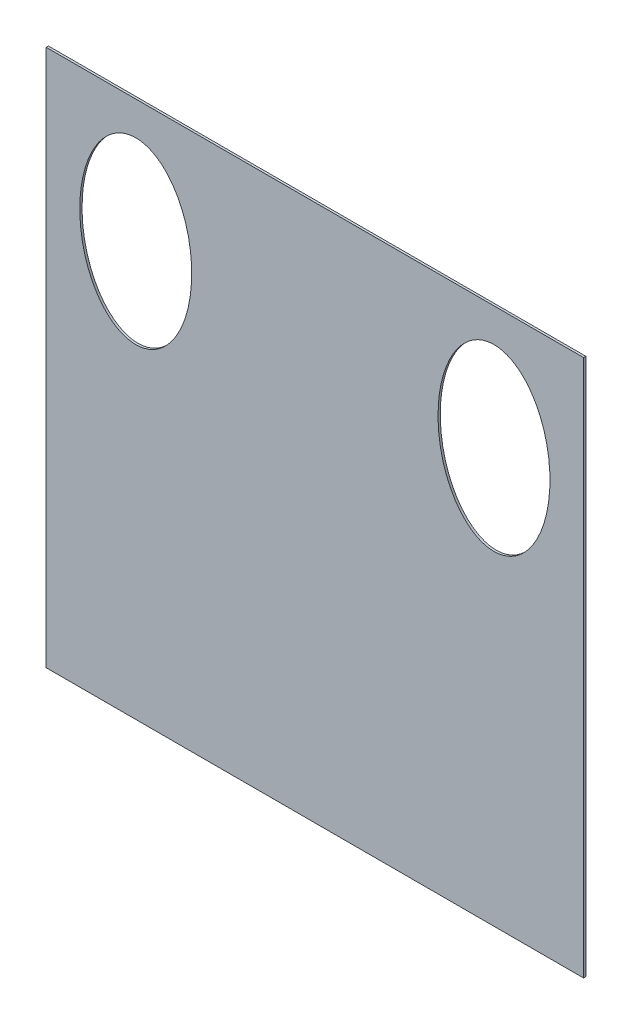
ISO-10303-21;
HEADER;
FILE_DESCRIPTION(('STEP AP214'),'2;1');
FILE_NAME('part.step','',(''),(''),'','','');
FILE_SCHEMA(('AUTOMOTIVE_DESIGN { 1 0 10303 214 1 1 1 1 }'));
ENDSEC;
DATA;
#1=APPLICATION_CONTEXT('core data for automotive mechanical design processes');
#2=APPLICATION_PROTOCOL_DEFINITION('international standard','automotive_design',2000,#1);
#3=PRODUCT_CONTEXT('',#1,'mechanical');
#4=PRODUCT('Part','Part','',(#3));
#5=PRODUCT_RELATED_PRODUCT_CATEGORY('part','',(#4));
#6=PRODUCT_DEFINITION_FORMATION('','',#4);
#7=PRODUCT_DEFINITION_CONTEXT('part definition',#1,'design');
#8=PRODUCT_DEFINITION('design','',#6,#7);
#9=PRODUCT_DEFINITION_SHAPE('','',#8);
#10=(LENGTH_UNIT() NAMED_UNIT(*) SI_UNIT(.MILLI.,.METRE.));
#11=(NAMED_UNIT(*) PLANE_ANGLE_UNIT() SI_UNIT($,.RADIAN.));
#12=(NAMED_UNIT(*) SI_UNIT($,.STERADIAN.) SOLID_ANGLE_UNIT());
#13=UNCERTAINTY_MEASURE_WITH_UNIT(LENGTH_MEASURE(1.E-05),#10,'distance_accuracy_value','');
#14=(GEOMETRIC_REPRESENTATION_CONTEXT(3) GLOBAL_UNCERTAINTY_ASSIGNED_CONTEXT((#13)) GLOBAL_UNIT_ASSIGNED_CONTEXT((#10,
#11,#12)) REPRESENTATION_CONTEXT('',''));
#15=CARTESIAN_POINT('',(0.,0.,0.));
#16=DIRECTION('',(0.,0.,1.));
#17=DIRECTION('',(1.,0.,0.));
#18=AXIS2_PLACEMENT_3D('',#15,#16,#17);
#19=CARTESIAN_POINT('',(-183.887603305785,299.132231404959,2.54));
#20=DIRECTION('',(1.,0.,0.));
#21=DIRECTION('',(0.,0.,-1.));
#22=AXIS2_PLACEMENT_3D('',#19,#20,#21);
#23=PLANE('',#22);
#24=DIRECTION('',(0.,-1.,0.));
#25=VECTOR('',#24,1.);
#26=CARTESIAN_POINT('',(-183.887603305785,299.132231404959,0.));
#27=LINE('',#26,#25);
#28=CARTESIAN_POINT('',(-183.887603305785,299.132231404959,0.));
#29=VERTEX_POINT('',#28);
#30=CARTESIAN_POINT('',(-183.887603305785,-310.467768595041,0.));
#31=VERTEX_POINT('',#30);
#32=EDGE_CURVE('E96',#29,#31,#27,.T.);
#33=ORIENTED_EDGE('',*,*,#32,.T.);
#34=DIRECTION('',(0.,0.,-1.));
#35=VECTOR('',#34,1.);
#36=CARTESIAN_POINT('',(-183.887603305785,-310.467768595041,2.54));
#37=LINE('',#36,#35);
#38=CARTESIAN_POINT('',(-183.887603305785,-310.467768595041,2.54));
#39=VERTEX_POINT('',#38);
#40=EDGE_CURVE('E11',#39,#31,#37,.T.);
#41=ORIENTED_EDGE('',*,*,#40,.F.);
#42=DIRECTION('',(0.,-1.,0.));
#43=VECTOR('',#42,1.);
#44=CARTESIAN_POINT('',(-183.887603305785,299.132231404959,2.54));
#45=LINE('',#44,#43);
#46=CARTESIAN_POINT('',(-183.887603305785,299.132231404959,2.54));
#47=VERTEX_POINT('',#46);
#48=EDGE_CURVE('E84',#47,#39,#45,.T.);
#49=ORIENTED_EDGE('',*,*,#48,.F.);
#50=DIRECTION('',(0.,0.,-1.));
#51=VECTOR('',#50,1.);
#52=CARTESIAN_POINT('',(-183.887603305785,299.132231404959,2.54));
#53=LINE('',#52,#51);
#54=EDGE_CURVE('E92',#47,#29,#53,.T.);
#55=ORIENTED_EDGE('',*,*,#54,.T.);
#56=EDGE_LOOP('',(#33,#41,#49,#55));
#57=FACE_BOUND('',#56,.T.);
#58=ADVANCED_FACE('F33',(#57),#23,.F.);
#59=CARTESIAN_POINT('',(-183.887603305785,-310.467768595041,2.54));
#60=DIRECTION('',(0.,1.,0.));
#61=DIRECTION('',(-1.,0.,0.));
#62=AXIS2_PLACEMENT_3D('',#59,#60,#61);
#63=PLANE('',#62);
#64=DIRECTION('',(1.,0.,0.));
#65=VECTOR('',#64,1.);
#66=CARTESIAN_POINT('',(-183.887603305785,-310.467768595041,0.));
#67=LINE('',#66,#65);
#68=CARTESIAN_POINT('',(425.712396694215,-310.467768595041,0.));
#69=VERTEX_POINT('',#68);
#70=EDGE_CURVE('E88',#31,#69,#67,.T.);
#71=ORIENTED_EDGE('',*,*,#70,.T.);
#72=DIRECTION('',(0.,0.,-1.));
#73=VECTOR('',#72,1.);
#74=CARTESIAN_POINT('',(425.712396694215,-310.467768595041,2.54));
#75=LINE('',#74,#73);
#76=CARTESIAN_POINT('',(425.712396694215,-310.467768595041,2.54));
#77=VERTEX_POINT('',#76);
#78=EDGE_CURVE('E41',#77,#69,#75,.T.);
#79=ORIENTED_EDGE('',*,*,#78,.F.);
#80=DIRECTION('',(1.,0.,0.));
#81=VECTOR('',#80,1.);
#82=CARTESIAN_POINT('',(-183.887603305785,-310.467768595041,2.54));
#83=LINE('',#82,#81);
#84=EDGE_CURVE('E79',#39,#77,#83,.T.);
#85=ORIENTED_EDGE('',*,*,#84,.F.);
#86=ORIENTED_EDGE('',*,*,#40,.T.);
#87=EDGE_LOOP('',(#71,#79,#85,#86));
#88=FACE_BOUND('',#87,.T.);
#89=ADVANCED_FACE('F87',(#88),#63,.F.);
#90=CARTESIAN_POINT('',(425.712396694215,299.132231404959,2.54));
#91=DIRECTION('',(-1.,0.,0.));
#92=DIRECTION('',(0.,-1.,0.));
#93=AXIS2_PLACEMENT_3D('',#90,#91,#92);
#94=PLANE('',#93);
#95=DIRECTION('',(0.,1.,0.));
#96=VECTOR('',#95,1.);
#97=CARTESIAN_POINT('',(425.712396694215,299.132231404959,0.));
#98=LINE('',#97,#96);
#99=CARTESIAN_POINT('',(425.712396694215,299.132231404959,0.));
#100=VERTEX_POINT('',#99);
#101=EDGE_CURVE('E66',#69,#100,#98,.T.);
#102=ORIENTED_EDGE('',*,*,#101,.T.);
#103=DIRECTION('',(0.,0.,-1.));
#104=VECTOR('',#103,1.);
#105=CARTESIAN_POINT('',(425.712396694215,299.132231404959,2.54));
#106=LINE('',#105,#104);
#107=CARTESIAN_POINT('',(425.712396694215,299.132231404959,2.54));
#108=VERTEX_POINT('',#107);
#109=EDGE_CURVE('E89',#108,#100,#106,.T.);
#110=ORIENTED_EDGE('',*,*,#109,.F.);
#111=DIRECTION('',(0.,1.,0.));
#112=VECTOR('',#111,1.);
#113=CARTESIAN_POINT('',(425.712396694215,299.132231404959,2.54));
#114=LINE('',#113,#112);
#115=EDGE_CURVE('E82',#77,#108,#114,.T.);
#116=ORIENTED_EDGE('',*,*,#115,.F.);
#117=ORIENTED_EDGE('',*,*,#78,.T.);
#118=EDGE_LOOP('',(#102,#110,#116,#117));
#119=FACE_BOUND('',#118,.T.);
#120=ADVANCED_FACE('F90',(#119),#94,.F.);
#121=CARTESIAN_POINT('',(-183.887603305785,299.132231404959,2.54));
#122=DIRECTION('',(0.,-1.,0.));
#123=DIRECTION('',(0.,0.,-1.));
#124=AXIS2_PLACEMENT_3D('',#121,#122,#123);
#125=PLANE('',#124);
#126=DIRECTION('',(-1.,0.,0.));
#127=VECTOR('',#126,1.);
#128=CARTESIAN_POINT('',(-183.887603305785,299.132231404959,0.));
#129=LINE('',#128,#127);
#130=EDGE_CURVE('E72',#100,#29,#129,.T.);
#131=ORIENTED_EDGE('',*,*,#130,.T.);
#132=ORIENTED_EDGE('',*,*,#54,.F.);
#133=DIRECTION('',(-1.,0.,0.));
#134=VECTOR('',#133,1.);
#135=CARTESIAN_POINT('',(-183.887603305785,299.132231404959,2.54));
#136=LINE('',#135,#134);
#137=EDGE_CURVE('E49',#108,#47,#136,.T.);
#138=ORIENTED_EDGE('',*,*,#137,.F.);
#139=ORIENTED_EDGE('',*,*,#109,.T.);
#140=EDGE_LOOP('',(#131,#132,#138,#139));
#141=FACE_BOUND('',#140,.T.);
#142=ADVANCED_FACE('F104',(#141),#125,.F.);
#143=CARTESIAN_POINT('',(0.,0.,2.54));
#144=DIRECTION('',(0.,0.,1.));
#145=DIRECTION('',(1.,0.,0.));
#146=AXIS2_PLACEMENT_3D('',#143,#144,#145);
#147=PLANE('',#146);
#148=CARTESIAN_POINT('',(-82.2876033057849,159.432231404959,2.54));
#149=DIRECTION('',(0.,0.,1.));
#150=DIRECTION('',(0.,-1.,0.));
#151=AXIS2_PLACEMENT_3D('',#148,#149,#150);
#152=ELLIPSE('',#151,101.6,63.5);
#153=CARTESIAN_POINT('',(-82.2876033057849,57.8322314049587,2.54));
#154=VERTEX_POINT('',#153);
#155=EDGE_CURVE('E117',#154,#154,#152,.T.);
#156=ORIENTED_EDGE('',*,*,#155,.F.);
#157=EDGE_LOOP('',(#156));
#158=FACE_BOUND('',#157,.T.);
#159=CARTESIAN_POINT('',(324.112396694215,159.432231404959,2.54));
#160=DIRECTION('',(0.,0.,1.));
#161=DIRECTION('',(0.,-1.,0.));
#162=AXIS2_PLACEMENT_3D('',#159,#160,#161);
#163=ELLIPSE('',#162,101.6,63.5);
#164=CARTESIAN_POINT('',(324.112396694215,57.8322314049586,2.54));
#165=VERTEX_POINT('',#164);
#166=EDGE_CURVE('E110',#165,#165,#163,.T.);
#167=ORIENTED_EDGE('',*,*,#166,.F.);
#168=EDGE_LOOP('',(#167));
#169=FACE_BOUND('',#168,.T.);
#170=ORIENTED_EDGE('',*,*,#48,.T.);
#171=ORIENTED_EDGE('',*,*,#84,.T.);
#172=ORIENTED_EDGE('',*,*,#115,.T.);
#173=ORIENTED_EDGE('',*,*,#137,.T.);
#174=EDGE_LOOP('',(#170,#171,#172,#173));
#175=FACE_BOUND('',#174,.T.);
#176=ADVANCED_FACE('F80',(#158,#169,#175),#147,.T.);
#177=CARTESIAN_POINT('',(0.,0.,0.));
#178=DIRECTION('',(0.,0.,1.));
#179=DIRECTION('',(1.,0.,0.));
#180=AXIS2_PLACEMENT_3D('',#177,#178,#179);
#181=PLANE('',#180);
#182=CARTESIAN_POINT('',(-82.2876033057849,159.432231404959,0.));
#183=DIRECTION('',(0.,0.,1.));
#184=DIRECTION('',(0.,-1.,0.));
#185=AXIS2_PLACEMENT_3D('',#182,#183,#184);
#186=ELLIPSE('',#185,101.6,63.5);
#187=CARTESIAN_POINT('',(-82.2876033057849,57.8322314049587,0.));
#188=VERTEX_POINT('',#187);
#189=EDGE_CURVE('E99',#188,#188,#186,.T.);
#190=ORIENTED_EDGE('',*,*,#189,.T.);
#191=EDGE_LOOP('',(#190));
#192=FACE_BOUND('',#191,.T.);
#193=CARTESIAN_POINT('',(324.112396694215,159.432231404959,0.));
#194=DIRECTION('',(0.,0.,1.));
#195=DIRECTION('',(0.,-1.,0.));
#196=AXIS2_PLACEMENT_3D('',#193,#194,#195);
#197=ELLIPSE('',#196,101.6,63.5);
#198=CARTESIAN_POINT('',(324.112396694215,57.8322314049586,0.));
#199=VERTEX_POINT('',#198);
#200=EDGE_CURVE('E113',#199,#199,#197,.T.);
#201=ORIENTED_EDGE('',*,*,#200,.T.);
#202=EDGE_LOOP('',(#201));
#203=FACE_BOUND('',#202,.T.);
#204=ORIENTED_EDGE('',*,*,#32,.F.);
#205=ORIENTED_EDGE('',*,*,#130,.F.);
#206=ORIENTED_EDGE('',*,*,#101,.F.);
#207=ORIENTED_EDGE('',*,*,#70,.F.);
#208=EDGE_LOOP('',(#204,#205,#206,#207));
#209=FACE_BOUND('',#208,.T.);
#210=ADVANCED_FACE('F107',(#192,#203,#209),#181,.F.);
#211=DIRECTION('',(0.,0.,1.));
#212=VECTOR('',#211,1.);
#213=SURFACE_OF_LINEAR_EXTRUSION('',#197,#212);
#214=ORIENTED_EDGE('',*,*,#200,.F.);
#215=EDGE_LOOP('',(#214));
#216=FACE_BOUND('',#215,.T.);
#217=ORIENTED_EDGE('',*,*,#166,.T.);
#218=EDGE_LOOP('',(#217));
#219=FACE_BOUND('',#218,.T.);
#220=ADVANCED_FACE('F120',(#216,#219),#213,.F.);
#221=DIRECTION('',(0.,0.,1.));
#222=VECTOR('',#221,1.);
#223=SURFACE_OF_LINEAR_EXTRUSION('',#186,#222);
#224=ORIENTED_EDGE('',*,*,#189,.F.);
#225=EDGE_LOOP('',(#224));
#226=FACE_BOUND('',#225,.T.);
#227=ORIENTED_EDGE('',*,*,#155,.T.);
#228=EDGE_LOOP('',(#227));
#229=FACE_BOUND('',#228,.T.);
#230=ADVANCED_FACE('F124',(#226,#229),#223,.F.);
#231=CLOSED_SHELL('',(#58,#89,#120,#142,#176,#210,#220,#230));
#232=MANIFOLD_SOLID_BREP('B2',#231);
#233=ADVANCED_BREP_SHAPE_REPRESENTATION('',(#18,#232),#14);
#234=SHAPE_DEFINITION_REPRESENTATION(#9,#233);
ENDSEC;
END-ISO-10303-21;
